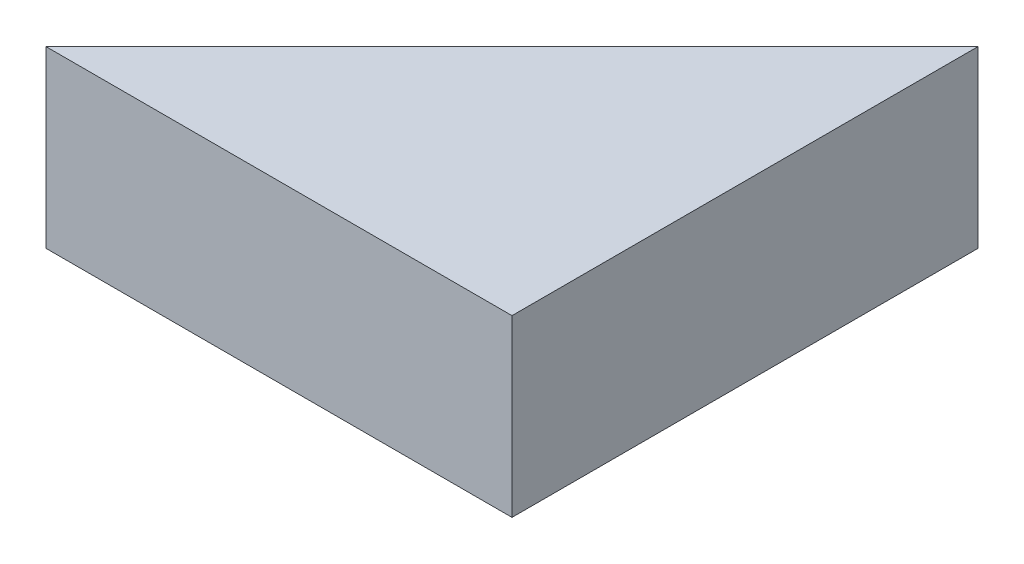
ISO-10303-21;
HEADER;
FILE_DESCRIPTION(('STEP AP214'),'2;1');
FILE_NAME('part.step','',(''),(''),'','','');
FILE_SCHEMA(('AUTOMOTIVE_DESIGN { 1 0 10303 214 1 1 1 1 }'));
ENDSEC;
DATA;
#1=APPLICATION_CONTEXT('core data for automotive mechanical design processes');
#2=APPLICATION_PROTOCOL_DEFINITION('international standard','automotive_design',2000,#1);
#3=PRODUCT_CONTEXT('',#1,'mechanical');
#4=PRODUCT('Part','Part','',(#3));
#5=PRODUCT_RELATED_PRODUCT_CATEGORY('part','',(#4));
#6=PRODUCT_DEFINITION_FORMATION('','',#4);
#7=PRODUCT_DEFINITION_CONTEXT('part definition',#1,'design');
#8=PRODUCT_DEFINITION('design','',#6,#7);
#9=PRODUCT_DEFINITION_SHAPE('','',#8);
#10=(LENGTH_UNIT() NAMED_UNIT(*) SI_UNIT(.MILLI.,.METRE.));
#11=(NAMED_UNIT(*) PLANE_ANGLE_UNIT() SI_UNIT($,.RADIAN.));
#12=(NAMED_UNIT(*) SI_UNIT($,.STERADIAN.) SOLID_ANGLE_UNIT());
#13=UNCERTAINTY_MEASURE_WITH_UNIT(LENGTH_MEASURE(1.E-05),#10,'distance_accuracy_value','');
#14=(GEOMETRIC_REPRESENTATION_CONTEXT(3) GLOBAL_UNCERTAINTY_ASSIGNED_CONTEXT((#13)) GLOBAL_UNIT_ASSIGNED_CONTEXT((#10,
#11,#12)) REPRESENTATION_CONTEXT('',''));
#15=CARTESIAN_POINT('',(0.,0.,0.));
#16=DIRECTION('',(0.,0.,1.));
#17=DIRECTION('',(1.,0.,0.));
#18=AXIS2_PLACEMENT_3D('',#15,#16,#17);
#19=CARTESIAN_POINT('',(-80.,30.,0.));
#20=DIRECTION('',(0.,0.,-1.));
#21=DIRECTION('',(-1.,0.,0.));
#22=AXIS2_PLACEMENT_3D('',#19,#20,#21);
#23=PLANE('',#22);
#24=DIRECTION('',(1.,0.,0.));
#25=VECTOR('',#24,1.);
#26=CARTESIAN_POINT('',(-80.,0.,0.));
#27=LINE('',#26,#25);
#28=CARTESIAN_POINT('',(-80.,0.,0.));
#29=VERTEX_POINT('',#28);
#30=CARTESIAN_POINT('',(0.,0.,0.));
#31=VERTEX_POINT('',#30);
#32=EDGE_CURVE('E80',#29,#31,#27,.T.);
#33=ORIENTED_EDGE('',*,*,#32,.T.);
#34=DIRECTION('',(0.,-1.,0.));
#35=VECTOR('',#34,1.);
#36=CARTESIAN_POINT('',(0.,30.,0.));
#37=LINE('',#36,#35);
#38=CARTESIAN_POINT('',(0.,30.,0.));
#39=VERTEX_POINT('',#38);
#40=EDGE_CURVE('E11',#39,#31,#37,.T.);
#41=ORIENTED_EDGE('',*,*,#40,.F.);
#42=DIRECTION('',(1.,0.,0.));
#43=VECTOR('',#42,1.);
#44=CARTESIAN_POINT('',(-80.,30.,0.));
#45=LINE('',#44,#43);
#46=CARTESIAN_POINT('',(-80.,30.,0.));
#47=VERTEX_POINT('',#46);
#48=EDGE_CURVE('E73',#47,#39,#45,.T.);
#49=ORIENTED_EDGE('',*,*,#48,.F.);
#50=DIRECTION('',(0.,-1.,0.));
#51=VECTOR('',#50,1.);
#52=CARTESIAN_POINT('',(-80.,30.,0.));
#53=LINE('',#52,#51);
#54=EDGE_CURVE('E81',#47,#29,#53,.T.);
#55=ORIENTED_EDGE('',*,*,#54,.T.);
#56=EDGE_LOOP('',(#33,#41,#49,#55));
#57=FACE_BOUND('',#56,.T.);
#58=ADVANCED_FACE('F33',(#57),#23,.F.);
#59=CARTESIAN_POINT('',(0.,30.,0.));
#60=DIRECTION('',(-1.,0.,0.));
#61=DIRECTION('',(0.,0.,1.));
#62=AXIS2_PLACEMENT_3D('',#59,#60,#61);
#63=PLANE('',#62);
#64=DIRECTION('',(0.,0.,-1.));
#65=VECTOR('',#64,1.);
#66=CARTESIAN_POINT('',(0.,0.,0.));
#67=LINE('',#66,#65);
#68=CARTESIAN_POINT('',(0.,0.,-80.));
#69=VERTEX_POINT('',#68);
#70=EDGE_CURVE('E61',#31,#69,#67,.T.);
#71=ORIENTED_EDGE('',*,*,#70,.T.);
#72=DIRECTION('',(0.,-1.,0.));
#73=VECTOR('',#72,1.);
#74=CARTESIAN_POINT('',(0.,30.,-80.));
#75=LINE('',#74,#73);
#76=CARTESIAN_POINT('',(0.,30.,-80.));
#77=VERTEX_POINT('',#76);
#78=EDGE_CURVE('E41',#77,#69,#75,.T.);
#79=ORIENTED_EDGE('',*,*,#78,.F.);
#80=DIRECTION('',(0.,0.,-1.));
#81=VECTOR('',#80,1.);
#82=CARTESIAN_POINT('',(0.,30.,0.));
#83=LINE('',#82,#81);
#84=EDGE_CURVE('E69',#39,#77,#83,.T.);
#85=ORIENTED_EDGE('',*,*,#84,.F.);
#86=ORIENTED_EDGE('',*,*,#40,.T.);
#87=EDGE_LOOP('',(#71,#79,#85,#86));
#88=FACE_BOUND('',#87,.T.);
#89=ADVANCED_FACE('F70',(#88),#63,.F.);
#90=CARTESIAN_POINT('',(0.,30.,-80.));
#91=DIRECTION('',(0.707106781186547,0.,0.707106781186547));
#92=DIRECTION('',(0.707106781186548,0.,-0.707106781186548));
#93=AXIS2_PLACEMENT_3D('',#90,#91,#92);
#94=PLANE('',#93);
#95=DIRECTION('',(-0.707106781186548,0.,0.707106781186548));
#96=VECTOR('',#95,1.);
#97=CARTESIAN_POINT('',(0.,0.,-80.));
#98=LINE('',#97,#96);
#99=EDGE_CURVE('E66',#69,#29,#98,.T.);
#100=ORIENTED_EDGE('',*,*,#99,.T.);
#101=ORIENTED_EDGE('',*,*,#54,.F.);
#102=DIRECTION('',(-0.707106781186548,0.,0.707106781186548));
#103=VECTOR('',#102,1.);
#104=CARTESIAN_POINT('',(0.,30.,-80.));
#105=LINE('',#104,#103);
#106=EDGE_CURVE('E49',#77,#47,#105,.T.);
#107=ORIENTED_EDGE('',*,*,#106,.F.);
#108=ORIENTED_EDGE('',*,*,#78,.T.);
#109=EDGE_LOOP('',(#100,#101,#107,#108));
#110=FACE_BOUND('',#109,.T.);
#111=ADVANCED_FACE('F88',(#110),#94,.F.);
#112=CARTESIAN_POINT('',(0.,30.,0.));
#113=DIRECTION('',(0.,1.,0.));
#114=DIRECTION('',(0.,0.,1.));
#115=AXIS2_PLACEMENT_3D('',#112,#113,#114);
#116=PLANE('',#115);
#117=ORIENTED_EDGE('',*,*,#48,.T.);
#118=ORIENTED_EDGE('',*,*,#84,.T.);
#119=ORIENTED_EDGE('',*,*,#106,.T.);
#120=EDGE_LOOP('',(#117,#118,#119));
#121=FACE_BOUND('',#120,.T.);
#122=ADVANCED_FACE('F76',(#121),#116,.T.);
#123=CARTESIAN_POINT('',(0.,0.,0.));
#124=DIRECTION('',(0.,1.,0.));
#125=DIRECTION('',(0.,0.,1.));
#126=AXIS2_PLACEMENT_3D('',#123,#124,#125);
#127=PLANE('',#126);
#128=ORIENTED_EDGE('',*,*,#32,.F.);
#129=ORIENTED_EDGE('',*,*,#99,.F.);
#130=ORIENTED_EDGE('',*,*,#70,.F.);
#131=EDGE_LOOP('',(#128,#129,#130));
#132=FACE_BOUND('',#131,.T.);
#133=ADVANCED_FACE('F89',(#132),#127,.F.);
#134=CLOSED_SHELL('',(#58,#89,#111,#122,#133));
#135=MANIFOLD_SOLID_BREP('B2',#134);
#136=ADVANCED_BREP_SHAPE_REPRESENTATION('',(#18,#135),#14);
#137=SHAPE_DEFINITION_REPRESENTATION(#9,#136);
ENDSEC;
END-ISO-10303-21;
